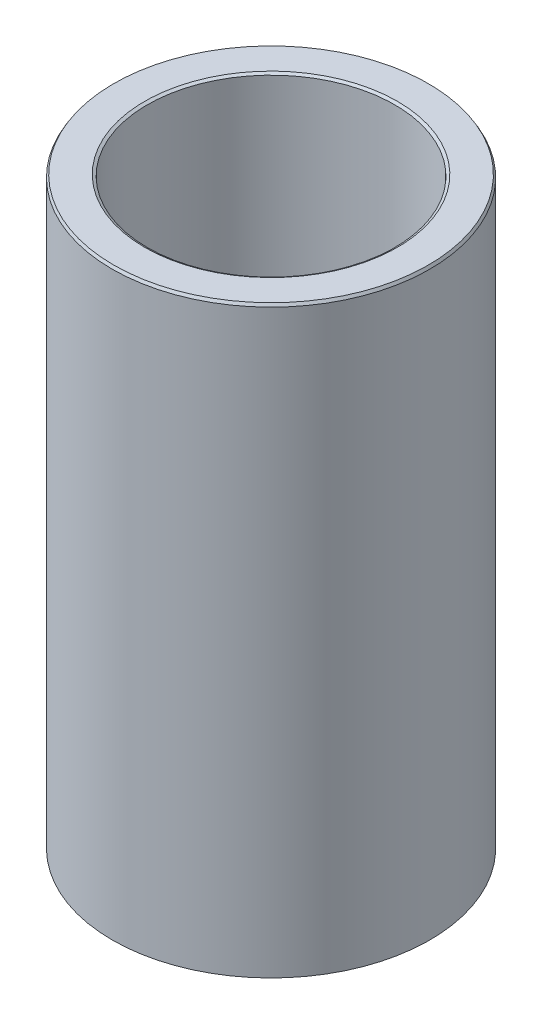
ISO-10303-21;
HEADER;
FILE_DESCRIPTION(('STEP AP214'),'2;1');
FILE_NAME('part.step','',(''),(''),'','','');
FILE_SCHEMA(('AUTOMOTIVE_DESIGN { 1 0 10303 214 1 1 1 1 }'));
ENDSEC;
DATA;
#1=APPLICATION_CONTEXT('core data for automotive mechanical design processes');
#2=APPLICATION_PROTOCOL_DEFINITION('international standard','automotive_design',2000,#1);
#3=PRODUCT_CONTEXT('',#1,'mechanical');
#4=PRODUCT('Part','Part','',(#3));
#5=PRODUCT_RELATED_PRODUCT_CATEGORY('part','',(#4));
#6=PRODUCT_DEFINITION_FORMATION('','',#4);
#7=PRODUCT_DEFINITION_CONTEXT('part definition',#1,'design');
#8=PRODUCT_DEFINITION('design','',#6,#7);
#9=PRODUCT_DEFINITION_SHAPE('','',#8);
#10=(LENGTH_UNIT() NAMED_UNIT(*) SI_UNIT(.MILLI.,.METRE.));
#11=(NAMED_UNIT(*) PLANE_ANGLE_UNIT() SI_UNIT($,.RADIAN.));
#12=(NAMED_UNIT(*) SI_UNIT($,.STERADIAN.) SOLID_ANGLE_UNIT());
#13=UNCERTAINTY_MEASURE_WITH_UNIT(LENGTH_MEASURE(1.E-05),#10,'distance_accuracy_value','');
#14=(GEOMETRIC_REPRESENTATION_CONTEXT(3) GLOBAL_UNCERTAINTY_ASSIGNED_CONTEXT((#13)) GLOBAL_UNIT_ASSIGNED_CONTEXT((#10,
#11,#12)) REPRESENTATION_CONTEXT('',''));
#15=CARTESIAN_POINT('',(0.,0.,0.));
#16=DIRECTION('',(0.,0.,1.));
#17=DIRECTION('',(1.,0.,0.));
#18=AXIS2_PLACEMENT_3D('',#15,#16,#17);
#19=CARTESIAN_POINT('',(0.,184.244225819055,0.));
#20=DIRECTION('',(0.,-1.,0.));
#21=DIRECTION('',(0.,0.,-1.));
#22=AXIS2_PLACEMENT_3D('',#19,#20,#21);
#23=CYLINDRICAL_SURFACE('',#22,50.);
#24=CARTESIAN_POINT('',(0.,0.495807211325999,0.));
#25=DIRECTION('',(0.,1.,0.));
#26=DIRECTION('',(0.,0.,1.));
#27=AXIS2_PLACEMENT_3D('',#24,#25,#26);
#28=CIRCLE('',#27,50.);
#29=CARTESIAN_POINT('',(0.,0.495807211325999,50.));
#30=VERTEX_POINT('',#29);
#31=EDGE_CURVE('E10',#30,#30,#28,.T.);
#32=ORIENTED_EDGE('',*,*,#31,.T.);
#33=EDGE_LOOP('',(#32));
#34=FACE_BOUND('',#33,.T.);
#35=CARTESIAN_POINT('',(0.,183.385462538279,0.));
#36=DIRECTION('',(0.,1.,0.));
#37=DIRECTION('',(0.,0.,1.));
#38=AXIS2_PLACEMENT_3D('',#35,#36,#37);
#39=CIRCLE('',#38,50.);
#40=CARTESIAN_POINT('',(0.,183.385462538279,50.));
#41=VERTEX_POINT('',#40);
#42=EDGE_CURVE('E50',#41,#41,#39,.F.);
#43=ORIENTED_EDGE('',*,*,#42,.T.);
#44=EDGE_LOOP('',(#43));
#45=FACE_BOUND('',#44,.T.);
#46=ADVANCED_FACE('F39',(#34,#45),#23,.T.);
#47=CARTESIAN_POINT('',(0.,184.244225819055,0.));
#48=DIRECTION('',(0.,1.,0.));
#49=DIRECTION('',(0.,0.,1.));
#50=AXIS2_PLACEMENT_3D('',#47,#48,#49);
#51=PLANE('',#50);
#52=CARTESIAN_POINT('',(0.,184.244225819055,0.));
#53=DIRECTION('',(0.,1.,0.));
#54=DIRECTION('',(0.,0.,1.));
#55=AXIS2_PLACEMENT_3D('',#52,#53,#54);
#56=CIRCLE('',#55,39.8020398691508);
#57=CARTESIAN_POINT('',(0.,184.244225819055,39.8020398691508));
#58=VERTEX_POINT('',#57);
#59=EDGE_CURVE('E58',#58,#58,#56,.F.);
#60=ORIENTED_EDGE('',*,*,#59,.T.);
#61=EDGE_LOOP('',(#60));
#62=FACE_BOUND('',#61,.T.);
#63=CARTESIAN_POINT('',(0.,184.244225819055,0.));
#64=DIRECTION('',(0.,1.,0.));
#65=DIRECTION('',(0.,0.,1.));
#66=AXIS2_PLACEMENT_3D('',#63,#64,#65);
#67=CIRCLE('',#66,49.504192788674);
#68=CARTESIAN_POINT('',(0.,184.244225819055,49.504192788674));
#69=VERTEX_POINT('',#68);
#70=EDGE_CURVE('E61',#69,#69,#67,.T.);
#71=ORIENTED_EDGE('',*,*,#70,.T.);
#72=EDGE_LOOP('',(#71));
#73=FACE_BOUND('',#72,.T.);
#74=ADVANCED_FACE('F88',(#62,#73),#51,.T.);
#75=CARTESIAN_POINT('',(0.,0.,0.));
#76=DIRECTION('',(0.,1.,0.));
#77=DIRECTION('',(0.,0.,1.));
#78=AXIS2_PLACEMENT_3D('',#75,#76,#77);
#79=PLANE('',#78);
#80=CARTESIAN_POINT('',(0.,0.,0.));
#81=DIRECTION('',(0.,1.,0.));
#82=DIRECTION('',(0.,0.,1.));
#83=AXIS2_PLACEMENT_3D('',#80,#81,#82);
#84=CIRCLE('',#83,39.4390837997011);
#85=CARTESIAN_POINT('',(0.,0.,39.4390837997011));
#86=VERTEX_POINT('',#85);
#87=EDGE_CURVE('E51',#86,#86,#84,.T.);
#88=ORIENTED_EDGE('',*,*,#87,.T.);
#89=EDGE_LOOP('',(#88));
#90=FACE_BOUND('',#89,.T.);
#91=CARTESIAN_POINT('',(0.,0.,0.));
#92=DIRECTION('',(0.,1.,0.));
#93=DIRECTION('',(0.,0.,1.));
#94=AXIS2_PLACEMENT_3D('',#91,#92,#93);
#95=CIRCLE('',#94,49.1412367192243);
#96=CARTESIAN_POINT('',(0.,0.,49.1412367192243));
#97=VERTEX_POINT('',#96);
#98=EDGE_CURVE('E54',#97,#97,#95,.F.);
#99=ORIENTED_EDGE('',*,*,#98,.T.);
#100=EDGE_LOOP('',(#99));
#101=FACE_BOUND('',#100,.T.);
#102=ADVANCED_FACE('F83',(#90,#101),#79,.F.);
#103=CARTESIAN_POINT('',(0.,184.244225819055,0.));
#104=DIRECTION('',(0.,-1.,0.));
#105=DIRECTION('',(0.,0.,-1.));
#106=AXIS2_PLACEMENT_3D('',#103,#104,#105);
#107=CYLINDRICAL_SURFACE('',#106,38.9432765883751);
#108=CARTESIAN_POINT('',(0.,183.748418607729,0.));
#109=DIRECTION('',(0.,1.,0.));
#110=DIRECTION('',(0.,0.,1.));
#111=AXIS2_PLACEMENT_3D('',#108,#109,#110);
#112=CIRCLE('',#111,38.9432765883751);
#113=CARTESIAN_POINT('',(0.,183.748418607729,38.9432765883751));
#114=VERTEX_POINT('',#113);
#115=EDGE_CURVE('E67',#114,#114,#112,.T.);
#116=ORIENTED_EDGE('',*,*,#115,.T.);
#117=EDGE_LOOP('',(#116));
#118=FACE_BOUND('',#117,.T.);
#119=CARTESIAN_POINT('',(0.,0.858763280775748,0.));
#120=DIRECTION('',(0.,1.,0.));
#121=DIRECTION('',(0.,0.,1.));
#122=AXIS2_PLACEMENT_3D('',#119,#120,#121);
#123=CIRCLE('',#122,38.9432765883751);
#124=CARTESIAN_POINT('',(0.,0.858763280775748,38.9432765883751));
#125=VERTEX_POINT('',#124);
#126=EDGE_CURVE('E69',#125,#125,#123,.F.);
#127=ORIENTED_EDGE('',*,*,#126,.T.);
#128=EDGE_LOOP('',(#127));
#129=FACE_BOUND('',#128,.T.);
#130=ADVANCED_FACE('F71',(#118,#129),#107,.F.);
#131=CARTESIAN_POINT('',(0.,183.748418607729,0.));
#132=DIRECTION('',(0.,1.,0.));
#133=DIRECTION('',(0.,0.,1.));
#134=AXIS2_PLACEMENT_3D('',#131,#132,#133);
#135=CONICAL_SURFACE('',#134,38.9432765883751,1.0471975511966);
#136=ORIENTED_EDGE('',*,*,#59,.F.);
#137=EDGE_LOOP('',(#136));
#138=FACE_BOUND('',#137,.T.);
#139=ORIENTED_EDGE('',*,*,#115,.F.);
#140=EDGE_LOOP('',(#139));
#141=FACE_BOUND('',#140,.T.);
#142=ADVANCED_FACE('F77',(#138,#141),#135,.F.);
#143=CARTESIAN_POINT('',(0.,0.,0.));
#144=DIRECTION('',(0.,-1.,0.));
#145=DIRECTION('',(0.,0.,-1.));
#146=AXIS2_PLACEMENT_3D('',#143,#144,#145);
#147=CONICAL_SURFACE('',#146,39.4390837997011,0.523598775598296);
#148=ORIENTED_EDGE('',*,*,#126,.F.);
#149=EDGE_LOOP('',(#148));
#150=FACE_BOUND('',#149,.T.);
#151=ORIENTED_EDGE('',*,*,#87,.F.);
#152=EDGE_LOOP('',(#151));
#153=FACE_BOUND('',#152,.T.);
#154=ADVANCED_FACE('F73',(#150,#153),#147,.F.);
#155=CARTESIAN_POINT('',(0.,0.495807211325999,0.));
#156=DIRECTION('',(0.,1.,0.));
#157=DIRECTION('',(0.,0.,1.));
#158=AXIS2_PLACEMENT_3D('',#155,#156,#157);
#159=CONICAL_SURFACE('',#158,50.,1.0471975511966);
#160=ORIENTED_EDGE('',*,*,#98,.F.);
#161=EDGE_LOOP('',(#160));
#162=FACE_BOUND('',#161,.T.);
#163=ORIENTED_EDGE('',*,*,#31,.F.);
#164=EDGE_LOOP('',(#163));
#165=FACE_BOUND('',#164,.T.);
#166=ADVANCED_FACE('F76',(#162,#165),#159,.T.);
#167=CARTESIAN_POINT('',(0.,184.244225819055,0.));
#168=DIRECTION('',(0.,-1.,0.));
#169=DIRECTION('',(0.,0.,-1.));
#170=AXIS2_PLACEMENT_3D('',#167,#168,#169);
#171=CONICAL_SURFACE('',#170,49.504192788674,0.523598775598298);
#172=ORIENTED_EDGE('',*,*,#42,.F.);
#173=EDGE_LOOP('',(#172));
#174=FACE_BOUND('',#173,.T.);
#175=ORIENTED_EDGE('',*,*,#70,.F.);
#176=EDGE_LOOP('',(#175));
#177=FACE_BOUND('',#176,.T.);
#178=ADVANCED_FACE('F45',(#174,#177),#171,.T.);
#179=CLOSED_SHELL('',(#46,#74,#102,#130,#142,#154,#166,#178));
#180=MANIFOLD_SOLID_BREP('B2',#179);
#181=ADVANCED_BREP_SHAPE_REPRESENTATION('',(#18,#180),#14);
#182=SHAPE_DEFINITION_REPRESENTATION(#9,#181);
ENDSEC;
END-ISO-10303-21;
